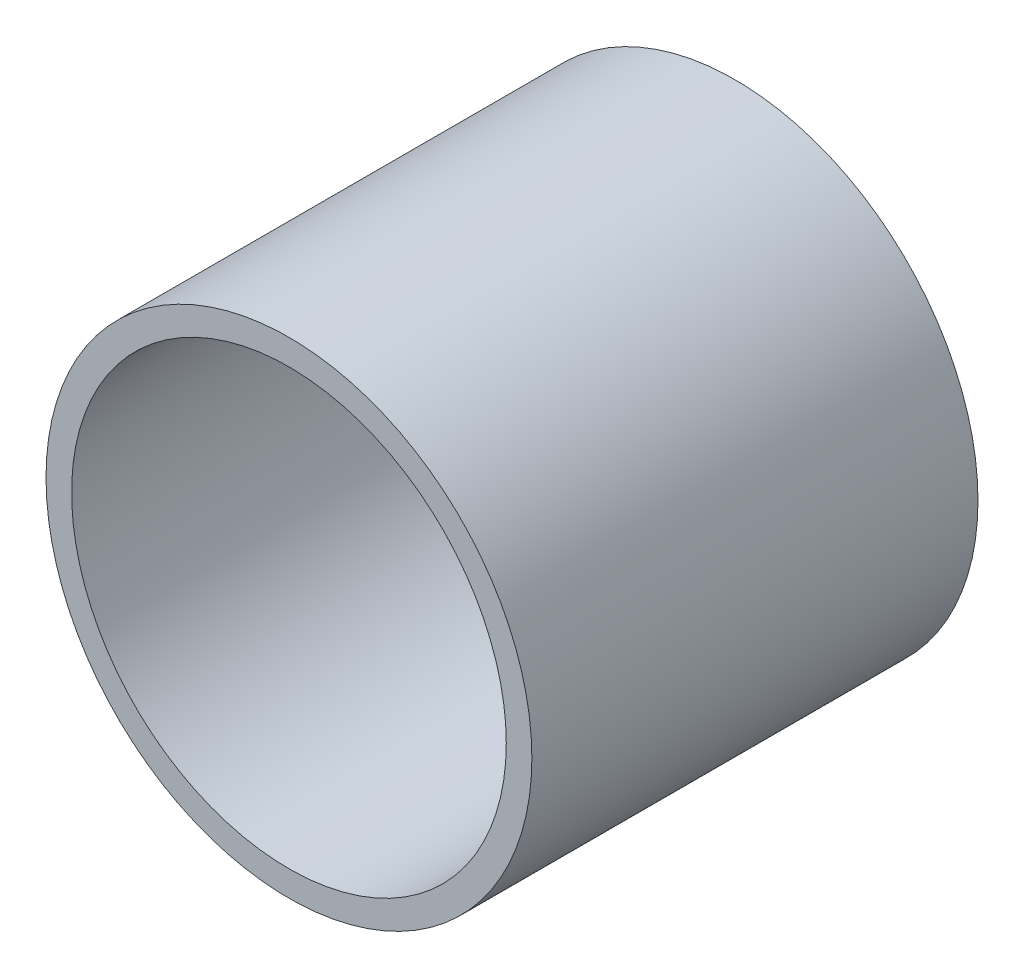
ISO-10303-21;
HEADER;
FILE_DESCRIPTION(('STEP AP214'),'2;1');
FILE_NAME('part.step','',(''),(''),'','','');
FILE_SCHEMA(('AUTOMOTIVE_DESIGN { 1 0 10303 214 1 1 1 1 }'));
ENDSEC;
DATA;
#1=APPLICATION_CONTEXT('core data for automotive mechanical design processes');
#2=APPLICATION_PROTOCOL_DEFINITION('international standard','automotive_design',2000,#1);
#3=PRODUCT_CONTEXT('',#1,'mechanical');
#4=PRODUCT('Part','Part','',(#3));
#5=PRODUCT_RELATED_PRODUCT_CATEGORY('part','',(#4));
#6=PRODUCT_DEFINITION_FORMATION('','',#4);
#7=PRODUCT_DEFINITION_CONTEXT('part definition',#1,'design');
#8=PRODUCT_DEFINITION('design','',#6,#7);
#9=PRODUCT_DEFINITION_SHAPE('','',#8);
#10=(LENGTH_UNIT() NAMED_UNIT(*) SI_UNIT(.MILLI.,.METRE.));
#11=(NAMED_UNIT(*) PLANE_ANGLE_UNIT() SI_UNIT($,.RADIAN.));
#12=(NAMED_UNIT(*) SI_UNIT($,.STERADIAN.) SOLID_ANGLE_UNIT());
#13=UNCERTAINTY_MEASURE_WITH_UNIT(LENGTH_MEASURE(1.E-05),#10,'distance_accuracy_value','');
#14=(GEOMETRIC_REPRESENTATION_CONTEXT(3) GLOBAL_UNCERTAINTY_ASSIGNED_CONTEXT((#13)) GLOBAL_UNIT_ASSIGNED_CONTEXT((#10,
#11,#12)) REPRESENTATION_CONTEXT('',''));
#15=CARTESIAN_POINT('',(0.,0.,0.));
#16=DIRECTION('',(0.,0.,1.));
#17=DIRECTION('',(1.,0.,0.));
#18=AXIS2_PLACEMENT_3D('',#15,#16,#17);
#19=CARTESIAN_POINT('',(0.,0.,52.4750000000001));
#20=DIRECTION('',(0.,0.,1.));
#21=DIRECTION('',(1.,0.,0.));
#22=AXIS2_PLACEMENT_3D('',#19,#20,#21);
#23=PLANE('',#22);
#24=CARTESIAN_POINT('',(0.,0.,52.4750000000001));
#25=DIRECTION('',(0.,0.,1.));
#26=DIRECTION('',(1.,0.,0.));
#27=AXIS2_PLACEMENT_3D('',#24,#25,#26);
#28=CIRCLE('',#27,57.15);
#29=CARTESIAN_POINT('',(57.15,0.,52.4750000000001));
#30=VERTEX_POINT('',#29);
#31=EDGE_CURVE('E13',#30,#30,#28,.T.);
#32=ORIENTED_EDGE('',*,*,#31,.T.);
#33=EDGE_LOOP('',(#32));
#34=FACE_BOUND('',#33,.T.);
#35=CARTESIAN_POINT('',(0.,0.,52.4750000000001));
#36=DIRECTION('',(0.,0.,1.));
#37=DIRECTION('',(1.,0.,0.));
#38=AXIS2_PLACEMENT_3D('',#35,#36,#37);
#39=CIRCLE('',#38,51.1302);
#40=CARTESIAN_POINT('',(51.1302,0.,52.4750000000001));
#41=VERTEX_POINT('',#40);
#42=EDGE_CURVE('E56',#41,#41,#39,.T.);
#43=ORIENTED_EDGE('',*,*,#42,.F.);
#44=EDGE_LOOP('',(#43));
#45=FACE_BOUND('',#44,.T.);
#46=ADVANCED_FACE('F45',(#34,#45),#23,.T.);
#47=CARTESIAN_POINT('',(0.,0.,-52.4750000000001));
#48=DIRECTION('',(0.,0.,1.));
#49=DIRECTION('',(1.,0.,0.));
#50=AXIS2_PLACEMENT_3D('',#47,#48,#49);
#51=PLANE('',#50);
#52=CARTESIAN_POINT('',(0.,0.,-52.4750000000001));
#53=DIRECTION('',(0.,0.,1.));
#54=DIRECTION('',(1.,0.,0.));
#55=AXIS2_PLACEMENT_3D('',#52,#53,#54);
#56=CIRCLE('',#55,57.15);
#57=CARTESIAN_POINT('',(57.15,0.,-52.4750000000001));
#58=VERTEX_POINT('',#57);
#59=EDGE_CURVE('E49',#58,#58,#56,.T.);
#60=ORIENTED_EDGE('',*,*,#59,.F.);
#61=EDGE_LOOP('',(#60));
#62=FACE_BOUND('',#61,.T.);
#63=CARTESIAN_POINT('',(0.,0.,-52.4750000000001));
#64=DIRECTION('',(0.,0.,1.));
#65=DIRECTION('',(1.,0.,0.));
#66=AXIS2_PLACEMENT_3D('',#63,#64,#65);
#67=CIRCLE('',#66,51.1302);
#68=CARTESIAN_POINT('',(51.1302,0.,-52.4750000000001));
#69=VERTEX_POINT('',#68);
#70=EDGE_CURVE('E58',#69,#69,#67,.T.);
#71=ORIENTED_EDGE('',*,*,#70,.T.);
#72=EDGE_LOOP('',(#71));
#73=FACE_BOUND('',#72,.T.);
#74=ADVANCED_FACE('F68',(#62,#73),#51,.F.);
#75=CARTESIAN_POINT('',(0.,0.,52.4750000000001));
#76=DIRECTION('',(0.,0.,-1.));
#77=DIRECTION('',(-1.,0.,0.));
#78=AXIS2_PLACEMENT_3D('',#75,#76,#77);
#79=CYLINDRICAL_SURFACE('',#78,57.15);
#80=ORIENTED_EDGE('',*,*,#31,.F.);
#81=EDGE_LOOP('',(#80));
#82=FACE_BOUND('',#81,.T.);
#83=ORIENTED_EDGE('',*,*,#59,.T.);
#84=EDGE_LOOP('',(#83));
#85=FACE_BOUND('',#84,.T.);
#86=ADVANCED_FACE('F47',(#82,#85),#79,.T.);
#87=CARTESIAN_POINT('',(0.,0.,52.4750000000001));
#88=DIRECTION('',(0.,0.,-1.));
#89=DIRECTION('',(-1.,0.,0.));
#90=AXIS2_PLACEMENT_3D('',#87,#88,#89);
#91=CYLINDRICAL_SURFACE('',#90,51.1302);
#92=ORIENTED_EDGE('',*,*,#42,.T.);
#93=EDGE_LOOP('',(#92));
#94=FACE_BOUND('',#93,.T.);
#95=ORIENTED_EDGE('',*,*,#70,.F.);
#96=EDGE_LOOP('',(#95));
#97=FACE_BOUND('',#96,.T.);
#98=ADVANCED_FACE('F64',(#94,#97),#91,.F.);
#99=CLOSED_SHELL('',(#46,#74,#86,#98));
#100=MANIFOLD_SOLID_BREP('B2',#99);
#101=ADVANCED_BREP_SHAPE_REPRESENTATION('',(#18,#100),#14);
#102=SHAPE_DEFINITION_REPRESENTATION(#9,#101);
ENDSEC;
END-ISO-10303-21;
